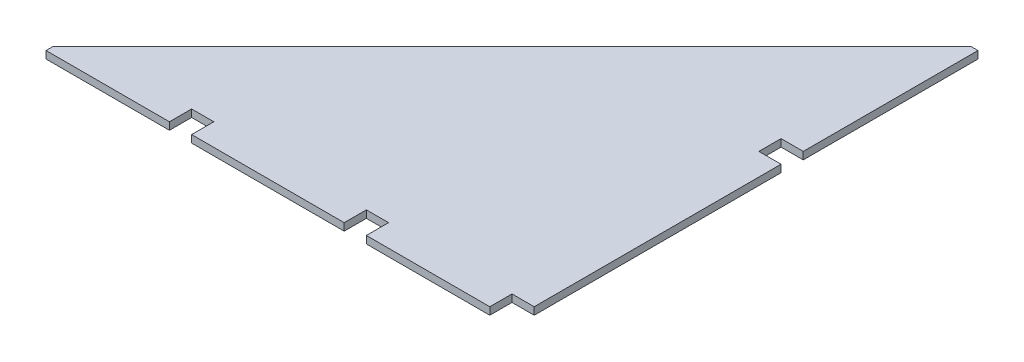
ISO-10303-21;
HEADER;
FILE_DESCRIPTION(('STEP AP214'),'2;1');
FILE_NAME('part.step','',(''),(''),'','','');
FILE_SCHEMA(('AUTOMOTIVE_DESIGN { 1 0 10303 214 1 1 1 1 }'));
ENDSEC;
DATA;
#1=APPLICATION_CONTEXT('core data for automotive mechanical design processes');
#2=APPLICATION_PROTOCOL_DEFINITION('international standard','automotive_design',2000,#1);
#3=PRODUCT_CONTEXT('',#1,'mechanical');
#4=PRODUCT('Part','Part','',(#3));
#5=PRODUCT_RELATED_PRODUCT_CATEGORY('part','',(#4));
#6=PRODUCT_DEFINITION_FORMATION('','',#4);
#7=PRODUCT_DEFINITION_CONTEXT('part definition',#1,'design');
#8=PRODUCT_DEFINITION('design','',#6,#7);
#9=PRODUCT_DEFINITION_SHAPE('','',#8);
#10=(LENGTH_UNIT() NAMED_UNIT(*) SI_UNIT(.MILLI.,.METRE.));
#11=(NAMED_UNIT(*) PLANE_ANGLE_UNIT() SI_UNIT($,.RADIAN.));
#12=(NAMED_UNIT(*) SI_UNIT($,.STERADIAN.) SOLID_ANGLE_UNIT());
#13=UNCERTAINTY_MEASURE_WITH_UNIT(LENGTH_MEASURE(1.E-05),#10,'distance_accuracy_value','');
#14=(GEOMETRIC_REPRESENTATION_CONTEXT(3) GLOBAL_UNCERTAINTY_ASSIGNED_CONTEXT((#13)) GLOBAL_UNIT_ASSIGNED_CONTEXT((#10,
#11,#12)) REPRESENTATION_CONTEXT('',''));
#15=CARTESIAN_POINT('',(0.,0.,0.));
#16=DIRECTION('',(0.,0.,1.));
#17=DIRECTION('',(1.,0.,0.));
#18=AXIS2_PLACEMENT_3D('',#15,#16,#17);
#19=CARTESIAN_POINT('',(0.,12.7,-500.));
#20=DIRECTION('',(-1.,0.,0.));
#21=DIRECTION('',(0.,0.,1.));
#22=AXIS2_PLACEMENT_3D('',#19,#20,#21);
#23=PLANE('',#22);
#24=DIRECTION('',(0.,0.,-1.));
#25=VECTOR('',#24,1.);
#26=CARTESIAN_POINT('',(0.,0.,-500.));
#27=LINE('',#26,#25);
#28=CARTESIAN_POINT('',(0.,0.,-500.));
#29=VERTEX_POINT('',#28);
#30=CARTESIAN_POINT('',(0.,0.,-800.));
#31=VERTEX_POINT('',#30);
#32=EDGE_CURVE('E206',#29,#31,#27,.T.);
#33=ORIENTED_EDGE('',*,*,#32,.T.);
#34=DIRECTION('',(0.,-1.,0.));
#35=VECTOR('',#34,1.);
#36=CARTESIAN_POINT('',(0.,12.7,-800.));
#37=LINE('',#36,#35);
#38=CARTESIAN_POINT('',(0.,12.7,-800.));
#39=VERTEX_POINT('',#38);
#40=EDGE_CURVE('E11',#39,#31,#37,.T.);
#41=ORIENTED_EDGE('',*,*,#40,.F.);
#42=DIRECTION('',(0.,0.,-1.));
#43=VECTOR('',#42,1.);
#44=CARTESIAN_POINT('',(0.,12.7,-500.));
#45=LINE('',#44,#43);
#46=CARTESIAN_POINT('',(0.,12.7,-500.));
#47=VERTEX_POINT('',#46);
#48=EDGE_CURVE('E261',#47,#39,#45,.T.);
#49=ORIENTED_EDGE('',*,*,#48,.F.);
#50=DIRECTION('',(0.,-1.,0.));
#51=VECTOR('',#50,1.);
#52=CARTESIAN_POINT('',(0.,12.7,-500.));
#53=LINE('',#52,#51);
#54=EDGE_CURVE('E202',#47,#29,#53,.T.);
#55=ORIENTED_EDGE('',*,*,#54,.T.);
#56=EDGE_LOOP('',(#33,#41,#49,#55));
#57=FACE_BOUND('',#56,.T.);
#58=ADVANCED_FACE('F39',(#57),#23,.F.);
#59=CARTESIAN_POINT('',(0.,12.7,-800.));
#60=DIRECTION('',(0.,0.,1.));
#61=DIRECTION('',(1.,0.,0.));
#62=AXIS2_PLACEMENT_3D('',#59,#60,#61);
#63=PLANE('',#62);
#64=DIRECTION('',(-1.,0.,0.));
#65=VECTOR('',#64,1.);
#66=CARTESIAN_POINT('',(0.,0.,-800.));
#67=LINE('',#66,#65);
#68=CARTESIAN_POINT('',(-11.2,0.,-800.));
#69=VERTEX_POINT('',#68);
#70=EDGE_CURVE('E210',#31,#69,#67,.T.);
#71=ORIENTED_EDGE('',*,*,#70,.T.);
#72=DIRECTION('',(0.,-1.,0.));
#73=VECTOR('',#72,1.);
#74=CARTESIAN_POINT('',(-11.2,12.7,-800.));
#75=LINE('',#74,#73);
#76=CARTESIAN_POINT('',(-11.2,12.7,-800.));
#77=VERTEX_POINT('',#76);
#78=EDGE_CURVE('E48',#77,#69,#75,.T.);
#79=ORIENTED_EDGE('',*,*,#78,.F.);
#80=DIRECTION('',(-1.,0.,0.));
#81=VECTOR('',#80,1.);
#82=CARTESIAN_POINT('',(0.,12.7,-800.));
#83=LINE('',#82,#81);
#84=EDGE_CURVE('E132',#39,#77,#83,.T.);
#85=ORIENTED_EDGE('',*,*,#84,.F.);
#86=ORIENTED_EDGE('',*,*,#40,.T.);
#87=EDGE_LOOP('',(#71,#79,#85,#86));
#88=FACE_BOUND('',#87,.T.);
#89=ADVANCED_FACE('F404',(#88),#63,.F.);
#90=CARTESIAN_POINT('',(-800.,12.7,-11.1999999999999));
#91=DIRECTION('',(0.707106781186548,0.,0.707106781186547));
#92=DIRECTION('',(0.707106781186547,0.,-0.707106781186548));
#93=AXIS2_PLACEMENT_3D('',#90,#91,#92);
#94=PLANE('',#93);
#95=DIRECTION('',(-0.707106781186547,0.,0.707106781186548));
#96=VECTOR('',#95,1.);
#97=CARTESIAN_POINT('',(-800.,0.,-11.1999999999999));
#98=LINE('',#97,#96);
#99=CARTESIAN_POINT('',(-800.,0.,-11.1999999999999));
#100=VERTEX_POINT('',#99);
#101=EDGE_CURVE('E213',#69,#100,#98,.T.);
#102=ORIENTED_EDGE('',*,*,#101,.T.);
#103=DIRECTION('',(0.,-1.,0.));
#104=VECTOR('',#103,1.);
#105=CARTESIAN_POINT('',(-800.,12.7,-11.1999999999999));
#106=LINE('',#105,#104);
#107=CARTESIAN_POINT('',(-800.,12.7,-11.1999999999999));
#108=VERTEX_POINT('',#107);
#109=EDGE_CURVE('E316',#108,#100,#106,.T.);
#110=ORIENTED_EDGE('',*,*,#109,.F.);
#111=DIRECTION('',(-0.707106781186547,0.,0.707106781186548));
#112=VECTOR('',#111,1.);
#113=CARTESIAN_POINT('',(-800.,12.7,-11.1999999999999));
#114=LINE('',#113,#112);
#115=EDGE_CURVE('E326',#77,#108,#114,.T.);
#116=ORIENTED_EDGE('',*,*,#115,.F.);
#117=ORIENTED_EDGE('',*,*,#78,.T.);
#118=EDGE_LOOP('',(#102,#110,#116,#117));
#119=FACE_BOUND('',#118,.T.);
#120=ADVANCED_FACE('F324',(#119),#94,.F.);
#121=CARTESIAN_POINT('',(-800.,12.7,-11.1999999999999));
#122=DIRECTION('',(1.,0.,0.));
#123=DIRECTION('',(0.,0.,-1.));
#124=AXIS2_PLACEMENT_3D('',#121,#122,#123);
#125=PLANE('',#124);
#126=DIRECTION('',(0.,0.,1.));
#127=VECTOR('',#126,1.);
#128=CARTESIAN_POINT('',(-800.,0.,-11.1999999999999));
#129=LINE('',#128,#127);
#130=CARTESIAN_POINT('',(-800.,0.,0.));
#131=VERTEX_POINT('',#130);
#132=EDGE_CURVE('E216',#100,#131,#129,.T.);
#133=ORIENTED_EDGE('',*,*,#132,.T.);
#134=DIRECTION('',(0.,-1.,0.));
#135=VECTOR('',#134,1.);
#136=CARTESIAN_POINT('',(-800.,12.7,0.));
#137=LINE('',#136,#135);
#138=CARTESIAN_POINT('',(-800.,12.7,0.));
#139=VERTEX_POINT('',#138);
#140=EDGE_CURVE('E312',#139,#131,#137,.T.);
#141=ORIENTED_EDGE('',*,*,#140,.F.);
#142=DIRECTION('',(0.,0.,1.));
#143=VECTOR('',#142,1.);
#144=CARTESIAN_POINT('',(-800.,12.7,-11.1999999999999));
#145=LINE('',#144,#143);
#146=EDGE_CURVE('E345',#108,#139,#145,.T.);
#147=ORIENTED_EDGE('',*,*,#146,.F.);
#148=ORIENTED_EDGE('',*,*,#109,.T.);
#149=EDGE_LOOP('',(#133,#141,#147,#148));
#150=FACE_BOUND('',#149,.T.);
#151=ADVANCED_FACE('F335',(#150),#125,.F.);
#152=CARTESIAN_POINT('',(-800.,12.7,0.));
#153=DIRECTION('',(0.,0.,-1.));
#154=DIRECTION('',(-1.,0.,0.));
#155=AXIS2_PLACEMENT_3D('',#152,#153,#154);
#156=PLANE('',#155);
#157=DIRECTION('',(1.,0.,0.));
#158=VECTOR('',#157,1.);
#159=CARTESIAN_POINT('',(-800.,0.,0.));
#160=LINE('',#159,#158);
#161=CARTESIAN_POINT('',(-588.1,0.,0.));
#162=VERTEX_POINT('',#161);
#163=EDGE_CURVE('E219',#131,#162,#160,.T.);
#164=ORIENTED_EDGE('',*,*,#163,.T.);
#165=DIRECTION('',(0.,-1.,0.));
#166=VECTOR('',#165,1.);
#167=CARTESIAN_POINT('',(-588.1,12.7,0.));
#168=LINE('',#167,#166);
#169=CARTESIAN_POINT('',(-588.1,12.7,0.));
#170=VERTEX_POINT('',#169);
#171=EDGE_CURVE('E308',#170,#162,#168,.T.);
#172=ORIENTED_EDGE('',*,*,#171,.F.);
#173=DIRECTION('',(1.,0.,0.));
#174=VECTOR('',#173,1.);
#175=CARTESIAN_POINT('',(-800.,12.7,0.));
#176=LINE('',#175,#174);
#177=EDGE_CURVE('E341',#139,#170,#176,.T.);
#178=ORIENTED_EDGE('',*,*,#177,.F.);
#179=ORIENTED_EDGE('',*,*,#140,.T.);
#180=EDGE_LOOP('',(#164,#172,#178,#179));
#181=FACE_BOUND('',#180,.T.);
#182=ADVANCED_FACE('F339',(#181),#156,.F.);
#183=CARTESIAN_POINT('',(-588.1,12.7,0.));
#184=DIRECTION('',(-1.,0.,0.));
#185=DIRECTION('',(0.,0.,1.));
#186=AXIS2_PLACEMENT_3D('',#183,#184,#185);
#187=PLANE('',#186);
#188=DIRECTION('',(0.,0.,-1.));
#189=VECTOR('',#188,1.);
#190=CARTESIAN_POINT('',(-588.1,0.,0.));
#191=LINE('',#190,#189);
#192=CARTESIAN_POINT('',(-588.1,0.,-38.0999999999999));
#193=VERTEX_POINT('',#192);
#194=EDGE_CURVE('E222',#162,#193,#191,.T.);
#195=ORIENTED_EDGE('',*,*,#194,.T.);
#196=DIRECTION('',(0.,-1.,0.));
#197=VECTOR('',#196,1.);
#198=CARTESIAN_POINT('',(-588.1,12.7,-38.0999999999999));
#199=LINE('',#198,#197);
#200=CARTESIAN_POINT('',(-588.1,12.7,-38.0999999999999));
#201=VERTEX_POINT('',#200);
#202=EDGE_CURVE('E304',#201,#193,#199,.T.);
#203=ORIENTED_EDGE('',*,*,#202,.F.);
#204=DIRECTION('',(0.,0.,-1.));
#205=VECTOR('',#204,1.);
#206=CARTESIAN_POINT('',(-588.1,12.7,0.));
#207=LINE('',#206,#205);
#208=EDGE_CURVE('E344',#170,#201,#207,.T.);
#209=ORIENTED_EDGE('',*,*,#208,.F.);
#210=ORIENTED_EDGE('',*,*,#171,.T.);
#211=EDGE_LOOP('',(#195,#203,#209,#210));
#212=FACE_BOUND('',#211,.T.);
#213=ADVANCED_FACE('F417',(#212),#187,.F.);
#214=CARTESIAN_POINT('',(-588.1,12.7,-38.0999999999999));
#215=DIRECTION('',(0.,0.,-1.));
#216=DIRECTION('',(-1.,0.,0.));
#217=AXIS2_PLACEMENT_3D('',#214,#215,#216);
#218=PLANE('',#217);
#219=DIRECTION('',(1.,0.,0.));
#220=VECTOR('',#219,1.);
#221=CARTESIAN_POINT('',(-588.1,0.,-38.0999999999999));
#222=LINE('',#221,#220);
#223=CARTESIAN_POINT('',(-550.,0.,-38.0999999999999));
#224=VERTEX_POINT('',#223);
#225=EDGE_CURVE('E225',#193,#224,#222,.T.);
#226=ORIENTED_EDGE('',*,*,#225,.T.);
#227=DIRECTION('',(0.,-1.,0.));
#228=VECTOR('',#227,1.);
#229=CARTESIAN_POINT('',(-550.,12.7,-38.0999999999999));
#230=LINE('',#229,#228);
#231=CARTESIAN_POINT('',(-550.,12.7,-38.0999999999999));
#232=VERTEX_POINT('',#231);
#233=EDGE_CURVE('E300',#232,#224,#230,.T.);
#234=ORIENTED_EDGE('',*,*,#233,.F.);
#235=DIRECTION('',(1.,0.,0.));
#236=VECTOR('',#235,1.);
#237=CARTESIAN_POINT('',(-588.1,12.7,-38.0999999999999));
#238=LINE('',#237,#236);
#239=EDGE_CURVE('E349',#201,#232,#238,.T.);
#240=ORIENTED_EDGE('',*,*,#239,.F.);
#241=ORIENTED_EDGE('',*,*,#202,.T.);
#242=EDGE_LOOP('',(#226,#234,#240,#241));
#243=FACE_BOUND('',#242,.T.);
#244=ADVANCED_FACE('F420',(#243),#218,.F.);
#245=CARTESIAN_POINT('',(-550.,12.7,0.));
#246=DIRECTION('',(1.,0.,0.));
#247=DIRECTION('',(0.,0.,-1.));
#248=AXIS2_PLACEMENT_3D('',#245,#246,#247);
#249=PLANE('',#248);
#250=DIRECTION('',(0.,0.,1.));
#251=VECTOR('',#250,1.);
#252=CARTESIAN_POINT('',(-550.,0.,0.));
#253=LINE('',#252,#251);
#254=CARTESIAN_POINT('',(-550.,0.,0.));
#255=VERTEX_POINT('',#254);
#256=EDGE_CURVE('E228',#224,#255,#253,.T.);
#257=ORIENTED_EDGE('',*,*,#256,.T.);
#258=DIRECTION('',(0.,-1.,0.));
#259=VECTOR('',#258,1.);
#260=CARTESIAN_POINT('',(-550.,12.7,0.));
#261=LINE('',#260,#259);
#262=CARTESIAN_POINT('',(-550.,12.7,0.));
#263=VERTEX_POINT('',#262);
#264=EDGE_CURVE('E296',#263,#255,#261,.T.);
#265=ORIENTED_EDGE('',*,*,#264,.F.);
#266=DIRECTION('',(0.,0.,1.));
#267=VECTOR('',#266,1.);
#268=CARTESIAN_POINT('',(-550.,12.7,0.));
#269=LINE('',#268,#267);
#270=EDGE_CURVE('E356',#232,#263,#269,.T.);
#271=ORIENTED_EDGE('',*,*,#270,.F.);
#272=ORIENTED_EDGE('',*,*,#233,.T.);
#273=EDGE_LOOP('',(#257,#265,#271,#272));
#274=FACE_BOUND('',#273,.T.);
#275=ADVANCED_FACE('F424',(#274),#249,.F.);
#276=CARTESIAN_POINT('',(-550.,12.7,0.));
#277=DIRECTION('',(0.,0.,-1.));
#278=DIRECTION('',(-1.,0.,0.));
#279=AXIS2_PLACEMENT_3D('',#276,#277,#278);
#280=PLANE('',#279);
#281=DIRECTION('',(1.,0.,0.));
#282=VECTOR('',#281,1.);
#283=CARTESIAN_POINT('',(-550.,0.,0.));
#284=LINE('',#283,#282);
#285=CARTESIAN_POINT('',(-288.1,0.,0.));
#286=VERTEX_POINT('',#285);
#287=EDGE_CURVE('E231',#255,#286,#284,.T.);
#288=ORIENTED_EDGE('',*,*,#287,.T.);
#289=DIRECTION('',(0.,-1.,0.));
#290=VECTOR('',#289,1.);
#291=CARTESIAN_POINT('',(-288.1,12.7,0.));
#292=LINE('',#291,#290);
#293=CARTESIAN_POINT('',(-288.1,12.7,0.));
#294=VERTEX_POINT('',#293);
#295=EDGE_CURVE('E292',#294,#286,#292,.T.);
#296=ORIENTED_EDGE('',*,*,#295,.F.);
#297=DIRECTION('',(1.,0.,0.));
#298=VECTOR('',#297,1.);
#299=CARTESIAN_POINT('',(-550.,12.7,0.));
#300=LINE('',#299,#298);
#301=EDGE_CURVE('E359',#263,#294,#300,.T.);
#302=ORIENTED_EDGE('',*,*,#301,.F.);
#303=ORIENTED_EDGE('',*,*,#264,.T.);
#304=EDGE_LOOP('',(#288,#296,#302,#303));
#305=FACE_BOUND('',#304,.T.);
#306=ADVANCED_FACE('F428',(#305),#280,.F.);
#307=CARTESIAN_POINT('',(-288.1,12.7,0.));
#308=DIRECTION('',(-1.,0.,0.));
#309=DIRECTION('',(0.,0.,1.));
#310=AXIS2_PLACEMENT_3D('',#307,#308,#309);
#311=PLANE('',#310);
#312=DIRECTION('',(0.,0.,-1.));
#313=VECTOR('',#312,1.);
#314=CARTESIAN_POINT('',(-288.1,0.,0.));
#315=LINE('',#314,#313);
#316=CARTESIAN_POINT('',(-288.1,0.,-38.1));
#317=VERTEX_POINT('',#316);
#318=EDGE_CURVE('E234',#286,#317,#315,.T.);
#319=ORIENTED_EDGE('',*,*,#318,.T.);
#320=DIRECTION('',(0.,-1.,0.));
#321=VECTOR('',#320,1.);
#322=CARTESIAN_POINT('',(-288.1,12.7,-38.1));
#323=LINE('',#322,#321);
#324=CARTESIAN_POINT('',(-288.1,12.7,-38.1));
#325=VERTEX_POINT('',#324);
#326=EDGE_CURVE('E288',#325,#317,#323,.T.);
#327=ORIENTED_EDGE('',*,*,#326,.F.);
#328=DIRECTION('',(0.,0.,-1.));
#329=VECTOR('',#328,1.);
#330=CARTESIAN_POINT('',(-288.1,12.7,0.));
#331=LINE('',#330,#329);
#332=EDGE_CURVE('E362',#294,#325,#331,.T.);
#333=ORIENTED_EDGE('',*,*,#332,.F.);
#334=ORIENTED_EDGE('',*,*,#295,.T.);
#335=EDGE_LOOP('',(#319,#327,#333,#334));
#336=FACE_BOUND('',#335,.T.);
#337=ADVANCED_FACE('F432',(#336),#311,.F.);
#338=CARTESIAN_POINT('',(-288.1,12.7,-38.1));
#339=DIRECTION('',(0.,0.,-1.));
#340=DIRECTION('',(-1.,0.,0.));
#341=AXIS2_PLACEMENT_3D('',#338,#339,#340);
#342=PLANE('',#341);
#343=DIRECTION('',(1.,0.,0.));
#344=VECTOR('',#343,1.);
#345=CARTESIAN_POINT('',(-288.1,0.,-38.1));
#346=LINE('',#345,#344);
#347=CARTESIAN_POINT('',(-250.,0.,-38.1));
#348=VERTEX_POINT('',#347);
#349=EDGE_CURVE('E237',#317,#348,#346,.T.);
#350=ORIENTED_EDGE('',*,*,#349,.T.);
#351=DIRECTION('',(0.,-1.,0.));
#352=VECTOR('',#351,1.);
#353=CARTESIAN_POINT('',(-250.,12.7,-38.1));
#354=LINE('',#353,#352);
#355=CARTESIAN_POINT('',(-250.,12.7,-38.1));
#356=VERTEX_POINT('',#355);
#357=EDGE_CURVE('E284',#356,#348,#354,.T.);
#358=ORIENTED_EDGE('',*,*,#357,.F.);
#359=DIRECTION('',(1.,0.,0.));
#360=VECTOR('',#359,1.);
#361=CARTESIAN_POINT('',(-288.1,12.7,-38.1));
#362=LINE('',#361,#360);
#363=EDGE_CURVE('E365',#325,#356,#362,.T.);
#364=ORIENTED_EDGE('',*,*,#363,.F.);
#365=ORIENTED_EDGE('',*,*,#326,.T.);
#366=EDGE_LOOP('',(#350,#358,#364,#365));
#367=FACE_BOUND('',#366,.T.);
#368=ADVANCED_FACE('F436',(#367),#342,.F.);
#369=CARTESIAN_POINT('',(-250.,12.7,0.));
#370=DIRECTION('',(1.,0.,0.));
#371=DIRECTION('',(0.,0.,-1.));
#372=AXIS2_PLACEMENT_3D('',#369,#370,#371);
#373=PLANE('',#372);
#374=DIRECTION('',(0.,0.,1.));
#375=VECTOR('',#374,1.);
#376=CARTESIAN_POINT('',(-250.,0.,0.));
#377=LINE('',#376,#375);
#378=CARTESIAN_POINT('',(-250.,0.,0.));
#379=VERTEX_POINT('',#378);
#380=EDGE_CURVE('E240',#348,#379,#377,.T.);
#381=ORIENTED_EDGE('',*,*,#380,.T.);
#382=DIRECTION('',(0.,-1.,0.));
#383=VECTOR('',#382,1.);
#384=CARTESIAN_POINT('',(-250.,12.7,0.));
#385=LINE('',#384,#383);
#386=CARTESIAN_POINT('',(-250.,12.7,0.));
#387=VERTEX_POINT('',#386);
#388=EDGE_CURVE('E280',#387,#379,#385,.T.);
#389=ORIENTED_EDGE('',*,*,#388,.F.);
#390=DIRECTION('',(0.,0.,1.));
#391=VECTOR('',#390,1.);
#392=CARTESIAN_POINT('',(-250.,12.7,0.));
#393=LINE('',#392,#391);
#394=EDGE_CURVE('E368',#356,#387,#393,.T.);
#395=ORIENTED_EDGE('',*,*,#394,.F.);
#396=ORIENTED_EDGE('',*,*,#357,.T.);
#397=EDGE_LOOP('',(#381,#389,#395,#396));
#398=FACE_BOUND('',#397,.T.);
#399=ADVANCED_FACE('F440',(#398),#373,.F.);
#400=CARTESIAN_POINT('',(-38.1,12.7,0.));
#401=DIRECTION('',(0.,0.,-1.));
#402=DIRECTION('',(-1.,0.,0.));
#403=AXIS2_PLACEMENT_3D('',#400,#401,#402);
#404=PLANE('',#403);
#405=DIRECTION('',(1.,0.,0.));
#406=VECTOR('',#405,1.);
#407=CARTESIAN_POINT('',(-38.1,0.,0.));
#408=LINE('',#407,#406);
#409=CARTESIAN_POINT('',(-38.1,0.,0.));
#410=VERTEX_POINT('',#409);
#411=EDGE_CURVE('E243',#379,#410,#408,.T.);
#412=ORIENTED_EDGE('',*,*,#411,.T.);
#413=DIRECTION('',(0.,-1.,0.));
#414=VECTOR('',#413,1.);
#415=CARTESIAN_POINT('',(-38.1,12.7,0.));
#416=LINE('',#415,#414);
#417=CARTESIAN_POINT('',(-38.1,12.7,0.));
#418=VERTEX_POINT('',#417);
#419=EDGE_CURVE('E276',#418,#410,#416,.T.);
#420=ORIENTED_EDGE('',*,*,#419,.F.);
#421=DIRECTION('',(1.,0.,0.));
#422=VECTOR('',#421,1.);
#423=CARTESIAN_POINT('',(-38.1,12.7,0.));
#424=LINE('',#423,#422);
#425=EDGE_CURVE('E371',#387,#418,#424,.T.);
#426=ORIENTED_EDGE('',*,*,#425,.F.);
#427=ORIENTED_EDGE('',*,*,#388,.T.);
#428=EDGE_LOOP('',(#412,#420,#426,#427));
#429=FACE_BOUND('',#428,.T.);
#430=ADVANCED_FACE('F444',(#429),#404,.F.);
#431=CARTESIAN_POINT('',(-38.1,12.7,0.));
#432=DIRECTION('',(-1.,0.,0.));
#433=DIRECTION('',(0.,0.,1.));
#434=AXIS2_PLACEMENT_3D('',#431,#432,#433);
#435=PLANE('',#434);
#436=DIRECTION('',(0.,0.,-1.));
#437=VECTOR('',#436,1.);
#438=CARTESIAN_POINT('',(-38.1,0.,0.));
#439=LINE('',#438,#437);
#440=CARTESIAN_POINT('',(-38.1,0.,-38.1));
#441=VERTEX_POINT('',#440);
#442=EDGE_CURVE('E246',#410,#441,#439,.T.);
#443=ORIENTED_EDGE('',*,*,#442,.T.);
#444=DIRECTION('',(0.,-1.,0.));
#445=VECTOR('',#444,1.);
#446=CARTESIAN_POINT('',(-38.1,12.7,-38.1));
#447=LINE('',#446,#445);
#448=CARTESIAN_POINT('',(-38.1,12.7,-38.1));
#449=VERTEX_POINT('',#448);
#450=EDGE_CURVE('E272',#449,#441,#447,.T.);
#451=ORIENTED_EDGE('',*,*,#450,.F.);
#452=DIRECTION('',(0.,0.,-1.));
#453=VECTOR('',#452,1.);
#454=CARTESIAN_POINT('',(-38.1,12.7,0.));
#455=LINE('',#454,#453);
#456=EDGE_CURVE('E374',#418,#449,#455,.T.);
#457=ORIENTED_EDGE('',*,*,#456,.F.);
#458=ORIENTED_EDGE('',*,*,#419,.T.);
#459=EDGE_LOOP('',(#443,#451,#457,#458));
#460=FACE_BOUND('',#459,.T.);
#461=ADVANCED_FACE('F448',(#460),#435,.F.);
#462=CARTESIAN_POINT('',(0.,12.7,-38.1));
#463=DIRECTION('',(0.,0.,-1.));
#464=DIRECTION('',(-1.,0.,0.));
#465=AXIS2_PLACEMENT_3D('',#462,#463,#464);
#466=PLANE('',#465);
#467=DIRECTION('',(1.,0.,0.));
#468=VECTOR('',#467,1.);
#469=CARTESIAN_POINT('',(0.,0.,-38.1));
#470=LINE('',#469,#468);
#471=CARTESIAN_POINT('',(0.,0.,-38.1));
#472=VERTEX_POINT('',#471);
#473=EDGE_CURVE('E249',#441,#472,#470,.T.);
#474=ORIENTED_EDGE('',*,*,#473,.T.);
#475=DIRECTION('',(0.,-1.,0.));
#476=VECTOR('',#475,1.);
#477=CARTESIAN_POINT('',(0.,12.7,-38.1));
#478=LINE('',#477,#476);
#479=CARTESIAN_POINT('',(0.,12.7,-38.1));
#480=VERTEX_POINT('',#479);
#481=EDGE_CURVE('E268',#480,#472,#478,.T.);
#482=ORIENTED_EDGE('',*,*,#481,.F.);
#483=DIRECTION('',(1.,0.,0.));
#484=VECTOR('',#483,1.);
#485=CARTESIAN_POINT('',(0.,12.7,-38.1));
#486=LINE('',#485,#484);
#487=EDGE_CURVE('E377',#449,#480,#486,.T.);
#488=ORIENTED_EDGE('',*,*,#487,.F.);
#489=ORIENTED_EDGE('',*,*,#450,.T.);
#490=EDGE_LOOP('',(#474,#482,#488,#489));
#491=FACE_BOUND('',#490,.T.);
#492=ADVANCED_FACE('F385',(#491),#466,.F.);
#493=CARTESIAN_POINT('',(0.,12.7,-38.1));
#494=DIRECTION('',(-1.,0.,0.));
#495=DIRECTION('',(0.,0.,1.));
#496=AXIS2_PLACEMENT_3D('',#493,#494,#495);
#497=PLANE('',#496);
#498=DIRECTION('',(0.,0.,-1.));
#499=VECTOR('',#498,1.);
#500=CARTESIAN_POINT('',(0.,0.,-38.1));
#501=LINE('',#500,#499);
#502=CARTESIAN_POINT('',(0.,0.,-461.9));
#503=VERTEX_POINT('',#502);
#504=EDGE_CURVE('E252',#472,#503,#501,.T.);
#505=ORIENTED_EDGE('',*,*,#504,.T.);
#506=DIRECTION('',(0.,-1.,0.));
#507=VECTOR('',#506,1.);
#508=CARTESIAN_POINT('',(0.,12.7,-461.9));
#509=LINE('',#508,#507);
#510=CARTESIAN_POINT('',(0.,12.7,-461.9));
#511=VERTEX_POINT('',#510);
#512=EDGE_CURVE('E195',#511,#503,#509,.T.);
#513=ORIENTED_EDGE('',*,*,#512,.F.);
#514=DIRECTION('',(0.,0.,-1.));
#515=VECTOR('',#514,1.);
#516=CARTESIAN_POINT('',(0.,12.7,-38.1));
#517=LINE('',#516,#515);
#518=EDGE_CURVE('E184',#480,#511,#517,.T.);
#519=ORIENTED_EDGE('',*,*,#518,.F.);
#520=ORIENTED_EDGE('',*,*,#481,.T.);
#521=EDGE_LOOP('',(#505,#513,#519,#520));
#522=FACE_BOUND('',#521,.T.);
#523=ADVANCED_FACE('F389',(#522),#497,.F.);
#524=CARTESIAN_POINT('',(0.,12.7,-461.9));
#525=DIRECTION('',(0.,0.,1.));
#526=DIRECTION('',(1.,0.,0.));
#527=AXIS2_PLACEMENT_3D('',#524,#525,#526);
#528=PLANE('',#527);
#529=DIRECTION('',(-1.,0.,0.));
#530=VECTOR('',#529,1.);
#531=CARTESIAN_POINT('',(0.,0.,-461.9));
#532=LINE('',#531,#530);
#533=CARTESIAN_POINT('',(-38.1,0.,-461.9));
#534=VERTEX_POINT('',#533);
#535=EDGE_CURVE('E193',#503,#534,#532,.T.);
#536=ORIENTED_EDGE('',*,*,#535,.T.);
#537=DIRECTION('',(0.,-1.,0.));
#538=VECTOR('',#537,1.);
#539=CARTESIAN_POINT('',(-38.1,12.7,-461.9));
#540=LINE('',#539,#538);
#541=CARTESIAN_POINT('',(-38.1,12.7,-461.9));
#542=VERTEX_POINT('',#541);
#543=EDGE_CURVE('E190',#542,#534,#540,.T.);
#544=ORIENTED_EDGE('',*,*,#543,.F.);
#545=DIRECTION('',(-1.,0.,0.));
#546=VECTOR('',#545,1.);
#547=CARTESIAN_POINT('',(0.,12.7,-461.9));
#548=LINE('',#547,#546);
#549=EDGE_CURVE('E178',#511,#542,#548,.T.);
#550=ORIENTED_EDGE('',*,*,#549,.F.);
#551=ORIENTED_EDGE('',*,*,#512,.T.);
#552=EDGE_LOOP('',(#536,#544,#550,#551));
#553=FACE_BOUND('',#552,.T.);
#554=ADVANCED_FACE('F191',(#553),#528,.F.);
#555=CARTESIAN_POINT('',(-38.1,12.7,-461.9));
#556=DIRECTION('',(-1.,0.,0.));
#557=DIRECTION('',(0.,0.,1.));
#558=AXIS2_PLACEMENT_3D('',#555,#556,#557);
#559=PLANE('',#558);
#560=DIRECTION('',(0.,0.,-1.));
#561=VECTOR('',#560,1.);
#562=CARTESIAN_POINT('',(-38.1,0.,-461.9));
#563=LINE('',#562,#561);
#564=CARTESIAN_POINT('',(-38.1,0.,-500.));
#565=VERTEX_POINT('',#564);
#566=EDGE_CURVE('E118',#534,#565,#563,.T.);
#567=ORIENTED_EDGE('',*,*,#566,.T.);
#568=DIRECTION('',(0.,-1.,0.));
#569=VECTOR('',#568,1.);
#570=CARTESIAN_POINT('',(-38.1,12.7,-500.));
#571=LINE('',#570,#569);
#572=CARTESIAN_POINT('',(-38.1,12.7,-500.));
#573=VERTEX_POINT('',#572);
#574=EDGE_CURVE('E196',#573,#565,#571,.T.);
#575=ORIENTED_EDGE('',*,*,#574,.F.);
#576=DIRECTION('',(0.,0.,-1.));
#577=VECTOR('',#576,1.);
#578=CARTESIAN_POINT('',(-38.1,12.7,-461.9));
#579=LINE('',#578,#577);
#580=EDGE_CURVE('E182',#542,#573,#579,.T.);
#581=ORIENTED_EDGE('',*,*,#580,.F.);
#582=ORIENTED_EDGE('',*,*,#543,.T.);
#583=EDGE_LOOP('',(#567,#575,#581,#582));
#584=FACE_BOUND('',#583,.T.);
#585=ADVANCED_FACE('F198',(#584),#559,.F.);
#586=CARTESIAN_POINT('',(0.,12.7,-500.));
#587=DIRECTION('',(0.,0.,-1.));
#588=DIRECTION('',(-1.,0.,0.));
#589=AXIS2_PLACEMENT_3D('',#586,#587,#588);
#590=PLANE('',#589);
#591=DIRECTION('',(1.,0.,0.));
#592=VECTOR('',#591,1.);
#593=CARTESIAN_POINT('',(0.,0.,-500.));
#594=LINE('',#593,#592);
#595=EDGE_CURVE('E124',#565,#29,#594,.T.);
#596=ORIENTED_EDGE('',*,*,#595,.T.);
#597=ORIENTED_EDGE('',*,*,#54,.F.);
#598=DIRECTION('',(1.,0.,0.));
#599=VECTOR('',#598,1.);
#600=CARTESIAN_POINT('',(0.,12.7,-500.));
#601=LINE('',#600,#599);
#602=EDGE_CURVE('E56',#573,#47,#601,.T.);
#603=ORIENTED_EDGE('',*,*,#602,.F.);
#604=ORIENTED_EDGE('',*,*,#574,.T.);
#605=EDGE_LOOP('',(#596,#597,#603,#604));
#606=FACE_BOUND('',#605,.T.);
#607=ADVANCED_FACE('F393',(#606),#590,.F.);
#608=CARTESIAN_POINT('',(0.,12.7,0.));
#609=DIRECTION('',(0.,1.,0.));
#610=DIRECTION('',(0.,0.,1.));
#611=AXIS2_PLACEMENT_3D('',#608,#609,#610);
#612=PLANE('',#611);
#613=ORIENTED_EDGE('',*,*,#48,.T.);
#614=ORIENTED_EDGE('',*,*,#84,.T.);
#615=ORIENTED_EDGE('',*,*,#115,.T.);
#616=ORIENTED_EDGE('',*,*,#146,.T.);
#617=ORIENTED_EDGE('',*,*,#177,.T.);
#618=ORIENTED_EDGE('',*,*,#208,.T.);
#619=ORIENTED_EDGE('',*,*,#239,.T.);
#620=ORIENTED_EDGE('',*,*,#270,.T.);
#621=ORIENTED_EDGE('',*,*,#301,.T.);
#622=ORIENTED_EDGE('',*,*,#332,.T.);
#623=ORIENTED_EDGE('',*,*,#363,.T.);
#624=ORIENTED_EDGE('',*,*,#394,.T.);
#625=ORIENTED_EDGE('',*,*,#425,.T.);
#626=ORIENTED_EDGE('',*,*,#456,.T.);
#627=ORIENTED_EDGE('',*,*,#487,.T.);
#628=ORIENTED_EDGE('',*,*,#518,.T.);
#629=ORIENTED_EDGE('',*,*,#549,.T.);
#630=ORIENTED_EDGE('',*,*,#580,.T.);
#631=ORIENTED_EDGE('',*,*,#602,.T.);
#632=EDGE_LOOP('',(#613,#614,#615,#616,#617,#618,#619,#620,#621,#622,#623,#624,#625,#626,#627,
#628,#629,#630,#631));
#633=FACE_BOUND('',#632,.T.);
#634=ADVANCED_FACE('F180',(#633),#612,.T.);
#635=CARTESIAN_POINT('',(0.,0.,0.));
#636=DIRECTION('',(0.,1.,0.));
#637=DIRECTION('',(0.,0.,1.));
#638=AXIS2_PLACEMENT_3D('',#635,#636,#637);
#639=PLANE('',#638);
#640=ORIENTED_EDGE('',*,*,#32,.F.);
#641=ORIENTED_EDGE('',*,*,#595,.F.);
#642=ORIENTED_EDGE('',*,*,#566,.F.);
#643=ORIENTED_EDGE('',*,*,#535,.F.);
#644=ORIENTED_EDGE('',*,*,#504,.F.);
#645=ORIENTED_EDGE('',*,*,#473,.F.);
#646=ORIENTED_EDGE('',*,*,#442,.F.);
#647=ORIENTED_EDGE('',*,*,#411,.F.);
#648=ORIENTED_EDGE('',*,*,#380,.F.);
#649=ORIENTED_EDGE('',*,*,#349,.F.);
#650=ORIENTED_EDGE('',*,*,#318,.F.);
#651=ORIENTED_EDGE('',*,*,#287,.F.);
#652=ORIENTED_EDGE('',*,*,#256,.F.);
#653=ORIENTED_EDGE('',*,*,#225,.F.);
#654=ORIENTED_EDGE('',*,*,#194,.F.);
#655=ORIENTED_EDGE('',*,*,#163,.F.);
#656=ORIENTED_EDGE('',*,*,#132,.F.);
#657=ORIENTED_EDGE('',*,*,#101,.F.);
#658=ORIENTED_EDGE('',*,*,#70,.F.);
#659=EDGE_LOOP('',(#640,#641,#642,#643,#644,#645,#646,#647,#648,#649,#650,#651,#652,#653,#654,
#655,#656,#657,#658));
#660=FACE_BOUND('',#659,.T.);
#661=ADVANCED_FACE('F330',(#660),#639,.F.);
#662=CLOSED_SHELL('',(#58,#89,#120,#151,#182,#213,#244,#275,#306,#337,#368,#399,#430,#461,#492,
#523,#554,#585,#607,#634,#661));
#663=MANIFOLD_SOLID_BREP('B2',#662);
#664=ADVANCED_BREP_SHAPE_REPRESENTATION('',(#18,#663),#14);
#665=SHAPE_DEFINITION_REPRESENTATION(#9,#664);
ENDSEC;
END-ISO-10303-21;
